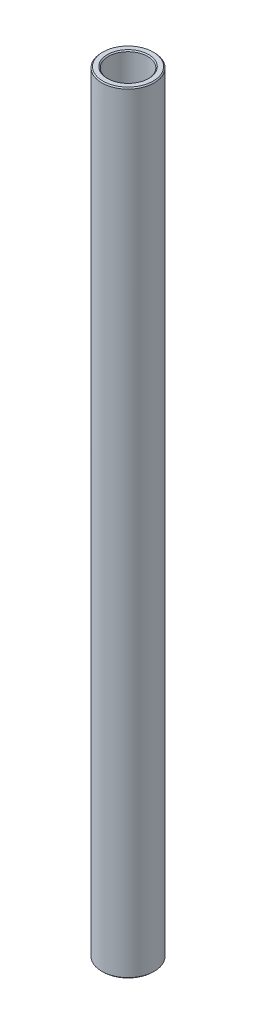
ISO-10303-21;
HEADER;
FILE_DESCRIPTION(('STEP AP214'),'2;1');
FILE_NAME('part.step','',(''),(''),'','','');
FILE_SCHEMA(('AUTOMOTIVE_DESIGN { 1 0 10303 214 1 1 1 1 }'));
ENDSEC;
DATA;
#1=APPLICATION_CONTEXT('core data for automotive mechanical design processes');
#2=APPLICATION_PROTOCOL_DEFINITION('international standard','automotive_design',2000,#1);
#3=PRODUCT_CONTEXT('',#1,'mechanical');
#4=PRODUCT('Part','Part','',(#3));
#5=PRODUCT_RELATED_PRODUCT_CATEGORY('part','',(#4));
#6=PRODUCT_DEFINITION_FORMATION('','',#4);
#7=PRODUCT_DEFINITION_CONTEXT('part definition',#1,'design');
#8=PRODUCT_DEFINITION('design','',#6,#7);
#9=PRODUCT_DEFINITION_SHAPE('','',#8);
#10=(LENGTH_UNIT() NAMED_UNIT(*) SI_UNIT(.MILLI.,.METRE.));
#11=(NAMED_UNIT(*) PLANE_ANGLE_UNIT() SI_UNIT($,.RADIAN.));
#12=(NAMED_UNIT(*) SI_UNIT($,.STERADIAN.) SOLID_ANGLE_UNIT());
#13=UNCERTAINTY_MEASURE_WITH_UNIT(LENGTH_MEASURE(1.E-05),#10,'distance_accuracy_value','');
#14=(GEOMETRIC_REPRESENTATION_CONTEXT(3) GLOBAL_UNCERTAINTY_ASSIGNED_CONTEXT((#13)) GLOBAL_UNIT_ASSIGNED_CONTEXT((#10,
#11,#12)) REPRESENTATION_CONTEXT('',''));
#15=CARTESIAN_POINT('',(0.,0.,0.));
#16=DIRECTION('',(0.,0.,1.));
#17=DIRECTION('',(1.,0.,0.));
#18=AXIS2_PLACEMENT_3D('',#15,#16,#17);
#19=CARTESIAN_POINT('',(6.3500000000003,60.1593651938211,0.));
#20=DIRECTION('',(2.61016471674075E-12,-1.,0.));
#21=DIRECTION('',(1.,2.61016471674075E-12,0.));
#22=AXIS2_PLACEMENT_3D('',#19,#20,#21);
#23=PLANE('',#22);
#24=CARTESIAN_POINT('',(-2.48618189269178E-11,60.1593651938045,0.));
#25=DIRECTION('',(2.61016471674075E-12,-1.,0.));
#26=DIRECTION('',(1.,2.61016471674075E-12,0.));
#27=AXIS2_PLACEMENT_3D('',#24,#25,#26);
#28=CIRCLE('',#27,5.016500000027);
#29=CARTESIAN_POINT('',(5.01650000000214,60.1593651938176,0.));
#30=VERTEX_POINT('',#29);
#31=EDGE_CURVE('E10',#30,#30,#28,.F.);
#32=ORIENTED_EDGE('',*,*,#31,.T.);
#33=EDGE_LOOP('',(#32));
#34=FACE_BOUND('',#33,.T.);
#35=CARTESIAN_POINT('',(-2.48618189269178E-11,60.1593651938045,0.));
#36=DIRECTION('',(2.61016471674075E-12,-1.,0.));
#37=DIRECTION('',(1.,2.61016471674075E-12,0.));
#38=AXIS2_PLACEMENT_3D('',#35,#36,#37);
#39=CIRCLE('',#38,6.09600000002723);
#40=CARTESIAN_POINT('',(6.09600000000237,60.1593651938204,0.));
#41=VERTEX_POINT('',#40);
#42=EDGE_CURVE('E38',#41,#41,#39,.T.);
#43=ORIENTED_EDGE('',*,*,#42,.T.);
#44=EDGE_LOOP('',(#43));
#45=FACE_BOUND('',#44,.T.);
#46=ADVANCED_FACE('F31',(#34,#45),#23,.T.);
#47=CARTESIAN_POINT('',(0.,50.634365193819,0.));
#48=DIRECTION('',(2.61016471674075E-12,-1.,0.));
#49=DIRECTION('',(1.,2.61016471674075E-12,0.));
#50=AXIS2_PLACEMENT_3D('',#47,#48,#49);
#51=CYLINDRICAL_SURFACE('',#50,4.7625000002688);
#52=CARTESIAN_POINT('',(-5.12045187757824E-10,246.807880402929,0.));
#53=DIRECTION('',(-2.61016471674088E-12,1.,0.));
#54=DIRECTION('',(-1.,-2.61016471674088E-12,0.));
#55=AXIS2_PLACEMENT_3D('',#52,#53,#54);
#56=CIRCLE('',#55,4.7625000002688);
#57=CARTESIAN_POINT('',(-4.76250000078084,246.807880402917,0.));
#58=VERTEX_POINT('',#57);
#59=EDGE_CURVE('E42',#58,#58,#56,.T.);
#60=ORIENTED_EDGE('',*,*,#59,.T.);
#61=EDGE_LOOP('',(#60));
#62=FACE_BOUND('',#61,.T.);
#63=CARTESIAN_POINT('',(-2.55248007643387E-11,60.4133651935627,0.));
#64=DIRECTION('',(2.61016471674075E-12,-1.,0.));
#65=DIRECTION('',(1.,2.61016471674075E-12,0.));
#66=AXIS2_PLACEMENT_3D('',#63,#64,#65);
#67=CIRCLE('',#66,4.7625000002688);
#68=CARTESIAN_POINT('',(4.76250000024327,60.4133651935751,0.));
#69=VERTEX_POINT('',#68);
#70=EDGE_CURVE('E46',#69,#69,#67,.T.);
#71=ORIENTED_EDGE('',*,*,#70,.T.);
#72=EDGE_LOOP('',(#71));
#73=FACE_BOUND('',#72,.T.);
#74=ADVANCED_FACE('F75',(#62,#73),#51,.F.);
#75=CARTESIAN_POINT('',(4.76250000000001,247.061880403183,0.));
#76=DIRECTION('',(-2.61016471674075E-12,1.,0.));
#77=DIRECTION('',(-1.,-2.61016471674075E-12,0.));
#78=AXIS2_PLACEMENT_3D('',#75,#76,#77);
#79=PLANE('',#78);
#80=CARTESIAN_POINT('',(-5.12708169596507E-10,247.061880403171,0.));
#81=DIRECTION('',(-2.61016471674075E-12,1.,0.));
#82=DIRECTION('',(-1.,-2.61016471674075E-12,0.));
#83=AXIS2_PLACEMENT_3D('',#80,#81,#82);
#84=CIRCLE('',#83,6.09600000051092);
#85=CARTESIAN_POINT('',(-6.09600000102363,247.061880403155,0.));
#86=VERTEX_POINT('',#85);
#87=EDGE_CURVE('E51',#86,#86,#84,.T.);
#88=ORIENTED_EDGE('',*,*,#87,.T.);
#89=EDGE_LOOP('',(#88));
#90=FACE_BOUND('',#89,.T.);
#91=CARTESIAN_POINT('',(-5.12708169596507E-10,247.061880403171,0.));
#92=DIRECTION('',(-2.61016471674075E-12,1.,0.));
#93=DIRECTION('',(-1.,-2.61016471674075E-12,0.));
#94=AXIS2_PLACEMENT_3D('',#91,#92,#93);
#95=CIRCLE('',#94,5.01650000051064);
#96=CARTESIAN_POINT('',(-5.01650000102334,247.061880403158,0.));
#97=VERTEX_POINT('',#96);
#98=EDGE_CURVE('E54',#97,#97,#95,.F.);
#99=ORIENTED_EDGE('',*,*,#98,.T.);
#100=EDGE_LOOP('',(#99));
#101=FACE_BOUND('',#100,.T.);
#102=ADVANCED_FACE('F80',(#90,#101),#79,.T.);
#103=CARTESIAN_POINT('',(0.,50.634365193819,0.));
#104=DIRECTION('',(2.61016471674075E-12,-1.,0.));
#105=DIRECTION('',(1.,2.61016471674075E-12,0.));
#106=AXIS2_PLACEMENT_3D('',#103,#104,#105);
#107=CYLINDRICAL_SURFACE('',#106,6.35000000026908);
#108=CARTESIAN_POINT('',(-5.12045187759086E-10,246.807880403413,0.));
#109=DIRECTION('',(-2.61016471674089E-12,1.,0.));
#110=DIRECTION('',(-1.,-2.61016471674089E-12,0.));
#111=AXIS2_PLACEMENT_3D('',#108,#109,#110);
#112=CIRCLE('',#111,6.35000000026908);
#113=CARTESIAN_POINT('',(-6.35000000078112,246.807880403396,0.));
#114=VERTEX_POINT('',#113);
#115=EDGE_CURVE('E57',#114,#114,#112,.F.);
#116=ORIENTED_EDGE('',*,*,#115,.T.);
#117=EDGE_LOOP('',(#116));
#118=FACE_BOUND('',#117,.T.);
#119=CARTESIAN_POINT('',(-2.55248007656012E-11,60.4133651940463,0.));
#120=DIRECTION('',(2.61016471674074E-12,-1.,0.));
#121=DIRECTION('',(1.,2.61016471674074E-12,0.));
#122=AXIS2_PLACEMENT_3D('',#119,#120,#121);
#123=CIRCLE('',#122,6.35000000026908);
#124=CARTESIAN_POINT('',(6.35000000024355,60.4133651940629,0.));
#125=VERTEX_POINT('',#124);
#126=EDGE_CURVE('E60',#125,#125,#123,.F.);
#127=ORIENTED_EDGE('',*,*,#126,.T.);
#128=EDGE_LOOP('',(#127));
#129=FACE_BOUND('',#128,.T.);
#130=ADVANCED_FACE('F64',(#118,#129),#107,.T.);
#131=CARTESIAN_POINT('',(-5.12045187759086E-10,246.807880403413,0.));
#132=DIRECTION('',(2.61016471674089E-12,-1.,0.));
#133=DIRECTION('',(1.,2.61016471674089E-12,0.));
#134=AXIS2_PLACEMENT_3D('',#131,#132,#133);
#135=CONICAL_SURFACE('',#134,6.35000000026908,0.785398163397358);
#136=ORIENTED_EDGE('',*,*,#87,.F.);
#137=EDGE_LOOP('',(#136));
#138=FACE_BOUND('',#137,.T.);
#139=ORIENTED_EDGE('',*,*,#115,.F.);
#140=EDGE_LOOP('',(#139));
#141=FACE_BOUND('',#140,.T.);
#142=ADVANCED_FACE('F85',(#138,#141),#135,.T.);
#143=CARTESIAN_POINT('',(-5.12708169596507E-10,247.061880403171,0.));
#144=DIRECTION('',(-2.61016471674088E-12,1.,0.));
#145=DIRECTION('',(-1.,-2.61016471674088E-12,0.));
#146=AXIS2_PLACEMENT_3D('',#143,#144,#145);
#147=CONICAL_SURFACE('',#146,5.01650000051063,0.78539816339744);
#148=ORIENTED_EDGE('',*,*,#59,.F.);
#149=EDGE_LOOP('',(#148));
#150=FACE_BOUND('',#149,.T.);
#151=ORIENTED_EDGE('',*,*,#98,.F.);
#152=EDGE_LOOP('',(#151));
#153=FACE_BOUND('',#152,.T.);
#154=ADVANCED_FACE('F72',(#150,#153),#147,.F.);
#155=CARTESIAN_POINT('',(-2.55248007643388E-11,60.4133651935627,0.));
#156=DIRECTION('',(2.61016471674075E-12,-1.,0.));
#157=DIRECTION('',(1.,2.61016471674075E-12,0.));
#158=AXIS2_PLACEMENT_3D('',#155,#156,#157);
#159=CONICAL_SURFACE('',#158,4.7625000002688,0.78539816339751);
#160=ORIENTED_EDGE('',*,*,#31,.F.);
#161=EDGE_LOOP('',(#160));
#162=FACE_BOUND('',#161,.T.);
#163=ORIENTED_EDGE('',*,*,#70,.F.);
#164=EDGE_LOOP('',(#163));
#165=FACE_BOUND('',#164,.T.);
#166=ADVANCED_FACE('F68',(#162,#165),#159,.F.);
#167=CARTESIAN_POINT('',(-2.48618189269178E-11,60.1593651938045,0.));
#168=DIRECTION('',(-2.61016471674074E-12,1.,0.));
#169=DIRECTION('',(-1.,-2.61016471674074E-12,0.));
#170=AXIS2_PLACEMENT_3D('',#167,#168,#169);
#171=CONICAL_SURFACE('',#170,6.09600000002723,0.785398163397484);
#172=ORIENTED_EDGE('',*,*,#126,.F.);
#173=EDGE_LOOP('',(#172));
#174=FACE_BOUND('',#173,.T.);
#175=ORIENTED_EDGE('',*,*,#42,.F.);
#176=EDGE_LOOP('',(#175));
#177=FACE_BOUND('',#176,.T.);
#178=ADVANCED_FACE('F33',(#174,#177),#171,.T.);
#179=CLOSED_SHELL('',(#46,#74,#102,#130,#142,#154,#166,#178));
#180=MANIFOLD_SOLID_BREP('B2',#179);
#181=ADVANCED_BREP_SHAPE_REPRESENTATION('',(#18,#180),#14);
#182=SHAPE_DEFINITION_REPRESENTATION(#9,#181);
ENDSEC;
END-ISO-10303-21;
